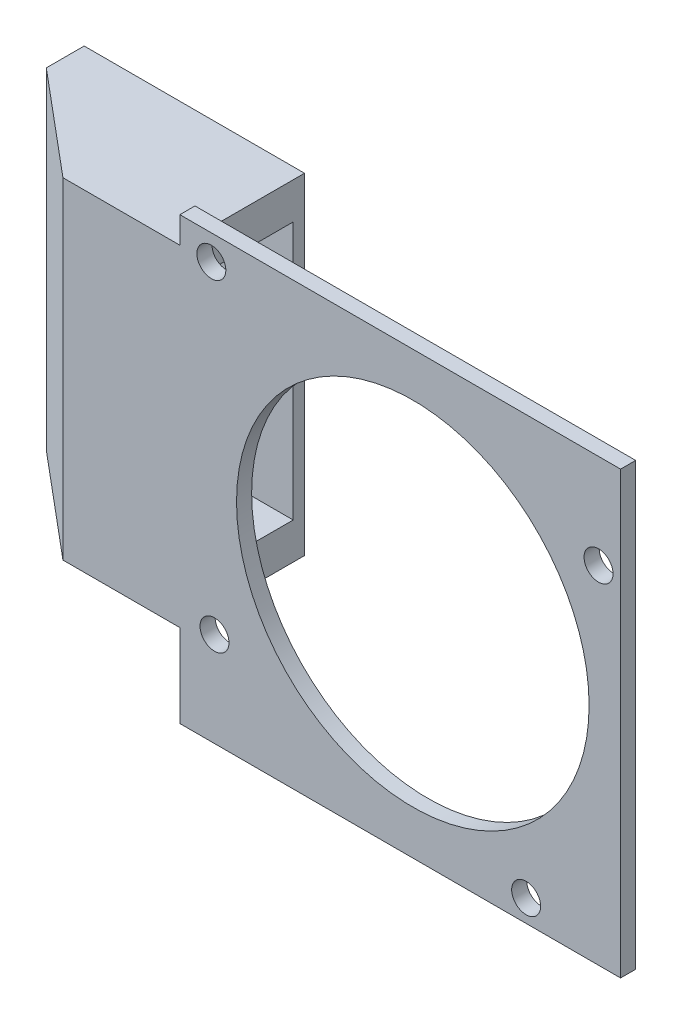
ISO-10303-21;
HEADER;
FILE_DESCRIPTION(('STEP AP214'),'2;1');
FILE_NAME('part.step','',(''),(''),'','','');
FILE_SCHEMA(('AUTOMOTIVE_DESIGN { 1 0 10303 214 1 1 1 1 }'));
ENDSEC;
DATA;
#1=APPLICATION_CONTEXT('core data for automotive mechanical design processes');
#2=APPLICATION_PROTOCOL_DEFINITION('international standard','automotive_design',2000,#1);
#3=PRODUCT_CONTEXT('',#1,'mechanical');
#4=PRODUCT('Part','Part','',(#3));
#5=PRODUCT_RELATED_PRODUCT_CATEGORY('part','',(#4));
#6=PRODUCT_DEFINITION_FORMATION('','',#4);
#7=PRODUCT_DEFINITION_CONTEXT('part definition',#1,'design');
#8=PRODUCT_DEFINITION('design','',#6,#7);
#9=PRODUCT_DEFINITION_SHAPE('','',#8);
#10=(LENGTH_UNIT() NAMED_UNIT(*) SI_UNIT(.MILLI.,.METRE.));
#11=(NAMED_UNIT(*) PLANE_ANGLE_UNIT() SI_UNIT($,.RADIAN.));
#12=(NAMED_UNIT(*) SI_UNIT($,.STERADIAN.) SOLID_ANGLE_UNIT());
#13=UNCERTAINTY_MEASURE_WITH_UNIT(LENGTH_MEASURE(1.E-05),#10,'distance_accuracy_value','');
#14=(GEOMETRIC_REPRESENTATION_CONTEXT(3) GLOBAL_UNCERTAINTY_ASSIGNED_CONTEXT((#13)) GLOBAL_UNIT_ASSIGNED_CONTEXT((#10,
#11,#12)) REPRESENTATION_CONTEXT('',''));
#15=CARTESIAN_POINT('',(0.,0.,0.));
#16=DIRECTION('',(0.,0.,1.));
#17=DIRECTION('',(1.,0.,0.));
#18=AXIS2_PLACEMENT_3D('',#15,#16,#17);
#19=CARTESIAN_POINT('',(29.8,35.,0.));
#20=DIRECTION('',(0.,1.,0.));
#21=DIRECTION('',(1.,0.,0.));
#22=AXIS2_PLACEMENT_3D('',#19,#20,#21);
#23=PLANE('',#22);
#24=DIRECTION('',(1.,0.,0.));
#25=VECTOR('',#24,1.);
#26=CARTESIAN_POINT('',(29.8,35.,0.));
#27=LINE('',#26,#25);
#28=CARTESIAN_POINT('',(0.,35.,0.));
#29=VERTEX_POINT('',#28);
#30=CARTESIAN_POINT('',(35.,35.,0.));
#31=VERTEX_POINT('',#30);
#32=EDGE_CURVE('E278',#29,#31,#27,.T.);
#33=ORIENTED_EDGE('',*,*,#32,.F.);
#34=DIRECTION('',(0.,0.,1.));
#35=VECTOR('',#34,1.);
#36=CARTESIAN_POINT('',(0.,35.,0.6));
#37=LINE('',#36,#35);
#38=CARTESIAN_POINT('',(0.,35.,1.2));
#39=VERTEX_POINT('',#38);
#40=EDGE_CURVE('E270',#29,#39,#37,.T.);
#41=ORIENTED_EDGE('',*,*,#40,.T.);
#42=DIRECTION('',(-1.,0.,0.));
#43=VECTOR('',#42,1.);
#44=CARTESIAN_POINT('',(29.8,35.,1.2));
#45=LINE('',#44,#43);
#46=CARTESIAN_POINT('',(35.,35.,1.2));
#47=VERTEX_POINT('',#46);
#48=EDGE_CURVE('E279',#47,#39,#45,.T.);
#49=ORIENTED_EDGE('',*,*,#48,.F.);
#50=DIRECTION('',(0.,0.,1.));
#51=VECTOR('',#50,1.);
#52=CARTESIAN_POINT('',(35.,35.,0.6));
#53=LINE('',#52,#51);
#54=EDGE_CURVE('E26',#31,#47,#53,.T.);
#55=ORIENTED_EDGE('',*,*,#54,.F.);
#56=EDGE_LOOP('',(#33,#41,#49,#55));
#57=FACE_BOUND('',#56,.T.);
#58=ADVANCED_FACE('F15',(#57),#23,.T.);
#59=CARTESIAN_POINT('',(5.2,0.,0.));
#60=DIRECTION('',(0.,-1.,0.));
#61=DIRECTION('',(0.,0.,-1.));
#62=AXIS2_PLACEMENT_3D('',#59,#60,#61);
#63=PLANE('',#62);
#64=DIRECTION('',(-1.,0.,0.));
#65=VECTOR('',#64,1.);
#66=CARTESIAN_POINT('',(5.2,0.,0.));
#67=LINE('',#66,#65);
#68=CARTESIAN_POINT('',(35.,0.,0.));
#69=VERTEX_POINT('',#68);
#70=CARTESIAN_POINT('',(0.,0.,0.));
#71=VERTEX_POINT('',#70);
#72=EDGE_CURVE('E326',#69,#71,#67,.T.);
#73=ORIENTED_EDGE('',*,*,#72,.F.);
#74=DIRECTION('',(0.,0.,1.));
#75=VECTOR('',#74,1.);
#76=CARTESIAN_POINT('',(35.,0.,0.6));
#77=LINE('',#76,#75);
#78=CARTESIAN_POINT('',(35.,0.,1.2));
#79=VERTEX_POINT('',#78);
#80=EDGE_CURVE('E10',#69,#79,#77,.T.);
#81=ORIENTED_EDGE('',*,*,#80,.T.);
#82=DIRECTION('',(1.,0.,0.));
#83=VECTOR('',#82,1.);
#84=CARTESIAN_POINT('',(5.2,0.,1.2));
#85=LINE('',#84,#83);
#86=CARTESIAN_POINT('',(0.,0.,1.2));
#87=VERTEX_POINT('',#86);
#88=EDGE_CURVE('E315',#87,#79,#85,.T.);
#89=ORIENTED_EDGE('',*,*,#88,.F.);
#90=DIRECTION('',(0.,0.,1.));
#91=VECTOR('',#90,1.);
#92=CARTESIAN_POINT('',(0.,0.,0.6));
#93=LINE('',#92,#91);
#94=EDGE_CURVE('E399',#71,#87,#93,.T.);
#95=ORIENTED_EDGE('',*,*,#94,.F.);
#96=EDGE_LOOP('',(#73,#81,#89,#95));
#97=FACE_BOUND('',#96,.T.);
#98=ADVANCED_FACE('F560',(#97),#63,.T.);
#99=CARTESIAN_POINT('',(35.,5.2,0.));
#100=DIRECTION('',(1.,0.,0.));
#101=DIRECTION('',(0.,1.,0.));
#102=AXIS2_PLACEMENT_3D('',#99,#100,#101);
#103=PLANE('',#102);
#104=DIRECTION('',(0.,-1.,0.));
#105=VECTOR('',#104,1.);
#106=CARTESIAN_POINT('',(35.,0.,0.));
#107=LINE('',#106,#105);
#108=EDGE_CURVE('E374',#31,#69,#107,.T.);
#109=ORIENTED_EDGE('',*,*,#108,.F.);
#110=ORIENTED_EDGE('',*,*,#54,.T.);
#111=DIRECTION('',(0.,1.,0.));
#112=VECTOR('',#111,1.);
#113=CARTESIAN_POINT('',(35.,0.,1.2));
#114=LINE('',#113,#112);
#115=EDGE_CURVE('E283',#79,#47,#114,.T.);
#116=ORIENTED_EDGE('',*,*,#115,.F.);
#117=ORIENTED_EDGE('',*,*,#80,.F.);
#118=EDGE_LOOP('',(#109,#110,#116,#117));
#119=FACE_BOUND('',#118,.T.);
#120=ADVANCED_FACE('F564',(#119),#103,.T.);
#121=CARTESIAN_POINT('',(18.5,17.5,0.));
#122=DIRECTION('',(0.,0.,1.));
#123=DIRECTION('',(1.,0.,0.));
#124=AXIS2_PLACEMENT_3D('',#121,#122,#123);
#125=CYLINDRICAL_SURFACE('',#124,14.);
#126=CARTESIAN_POINT('',(18.5,17.5,1.2));
#127=DIRECTION('',(0.,0.,-1.));
#128=DIRECTION('',(1.,0.,0.));
#129=AXIS2_PLACEMENT_3D('',#126,#127,#128);
#130=CIRCLE('',#129,14.);
#131=CARTESIAN_POINT('',(4.5,17.5,1.2));
#132=VERTEX_POINT('',#131);
#133=EDGE_CURVE('E282',#132,#132,#130,.T.);
#134=ORIENTED_EDGE('',*,*,#133,.F.);
#135=DIRECTION('',(0.,0.,-1.));
#136=VECTOR('',#135,1.);
#137=CARTESIAN_POINT('',(4.5,17.5,0.));
#138=LINE('',#137,#136);
#139=CARTESIAN_POINT('',(4.5,17.5,0.));
#140=VERTEX_POINT('',#139);
#141=EDGE_CURVE('E40',#132,#140,#138,.T.);
#142=ORIENTED_EDGE('',*,*,#141,.T.);
#143=CARTESIAN_POINT('',(18.5,17.5,0.));
#144=DIRECTION('',(0.,0.,-1.));
#145=DIRECTION('',(1.,0.,0.));
#146=AXIS2_PLACEMENT_3D('',#143,#144,#145);
#147=CIRCLE('',#146,14.);
#148=EDGE_CURVE('E343',#140,#140,#147,.T.);
#149=ORIENTED_EDGE('',*,*,#148,.T.);
#150=ORIENTED_EDGE('',*,*,#141,.F.);
#151=EDGE_LOOP('',(#134,#142,#149,#150));
#152=FACE_BOUND('',#151,.T.);
#153=ADVANCED_FACE('F879',(#152),#125,.F.);
#154=CARTESIAN_POINT('',(2.5,33.,0.));
#155=DIRECTION('',(0.,0.,1.));
#156=DIRECTION('',(1.,0.,0.));
#157=AXIS2_PLACEMENT_3D('',#154,#155,#156);
#158=CYLINDRICAL_SURFACE('',#157,1.15);
#159=CARTESIAN_POINT('',(2.5,33.,1.2));
#160=DIRECTION('',(0.,0.,-1.));
#161=DIRECTION('',(1.,0.,0.));
#162=AXIS2_PLACEMENT_3D('',#159,#160,#161);
#163=CIRCLE('',#162,1.15);
#164=CARTESIAN_POINT('',(1.35,33.,1.2));
#165=VERTEX_POINT('',#164);
#166=EDGE_CURVE('E378',#165,#165,#163,.T.);
#167=ORIENTED_EDGE('',*,*,#166,.F.);
#168=DIRECTION('',(0.,0.,-1.));
#169=VECTOR('',#168,1.);
#170=CARTESIAN_POINT('',(1.35,33.,0.));
#171=LINE('',#170,#169);
#172=CARTESIAN_POINT('',(1.35,33.,0.));
#173=VERTEX_POINT('',#172);
#174=EDGE_CURVE('E393',#165,#173,#171,.T.);
#175=ORIENTED_EDGE('',*,*,#174,.T.);
#176=CARTESIAN_POINT('',(2.5,33.,0.));
#177=DIRECTION('',(0.,0.,-1.));
#178=DIRECTION('',(1.,0.,0.));
#179=AXIS2_PLACEMENT_3D('',#176,#177,#178);
#180=CIRCLE('',#179,1.15);
#181=EDGE_CURVE('E310',#173,#173,#180,.T.);
#182=ORIENTED_EDGE('',*,*,#181,.T.);
#183=ORIENTED_EDGE('',*,*,#174,.F.);
#184=EDGE_LOOP('',(#167,#175,#182,#183));
#185=FACE_BOUND('',#184,.T.);
#186=ADVANCED_FACE('F834',(#185),#158,.F.);
#187=CARTESIAN_POINT('',(27.5,1.75,0.));
#188=DIRECTION('',(0.,0.,1.));
#189=DIRECTION('',(1.,0.,0.));
#190=AXIS2_PLACEMENT_3D('',#187,#188,#189);
#191=CYLINDRICAL_SURFACE('',#190,1.15);
#192=CARTESIAN_POINT('',(27.5,1.75,1.2));
#193=DIRECTION('',(0.,0.,-1.));
#194=DIRECTION('',(1.,0.,0.));
#195=AXIS2_PLACEMENT_3D('',#192,#193,#194);
#196=CIRCLE('',#195,1.15);
#197=CARTESIAN_POINT('',(26.35,1.75,1.2));
#198=VERTEX_POINT('',#197);
#199=EDGE_CURVE('E359',#198,#198,#196,.T.);
#200=ORIENTED_EDGE('',*,*,#199,.F.);
#201=DIRECTION('',(0.,0.,-1.));
#202=VECTOR('',#201,1.);
#203=CARTESIAN_POINT('',(26.35,1.75,0.));
#204=LINE('',#203,#202);
#205=CARTESIAN_POINT('',(26.35,1.75,0.));
#206=VERTEX_POINT('',#205);
#207=EDGE_CURVE('E446',#198,#206,#204,.T.);
#208=ORIENTED_EDGE('',*,*,#207,.T.);
#209=CARTESIAN_POINT('',(27.5,1.75,0.));
#210=DIRECTION('',(0.,0.,-1.));
#211=DIRECTION('',(1.,0.,0.));
#212=AXIS2_PLACEMENT_3D('',#209,#210,#211);
#213=CIRCLE('',#212,1.15);
#214=EDGE_CURVE('E306',#206,#206,#213,.T.);
#215=ORIENTED_EDGE('',*,*,#214,.T.);
#216=ORIENTED_EDGE('',*,*,#207,.F.);
#217=EDGE_LOOP('',(#200,#208,#215,#216));
#218=FACE_BOUND('',#217,.T.);
#219=ADVANCED_FACE('F829',(#218),#191,.F.);
#220=CARTESIAN_POINT('',(33.25,27.5,0.));
#221=DIRECTION('',(0.,0.,1.));
#222=DIRECTION('',(1.,0.,0.));
#223=AXIS2_PLACEMENT_3D('',#220,#221,#222);
#224=CYLINDRICAL_SURFACE('',#223,1.15);
#225=CARTESIAN_POINT('',(33.25,27.5,1.2));
#226=DIRECTION('',(0.,0.,-1.));
#227=DIRECTION('',(1.,0.,0.));
#228=AXIS2_PLACEMENT_3D('',#225,#226,#227);
#229=CIRCLE('',#228,1.15);
#230=CARTESIAN_POINT('',(32.1,27.5,1.2));
#231=VERTEX_POINT('',#230);
#232=EDGE_CURVE('E354',#231,#231,#229,.T.);
#233=ORIENTED_EDGE('',*,*,#232,.F.);
#234=DIRECTION('',(0.,0.,-1.));
#235=VECTOR('',#234,1.);
#236=CARTESIAN_POINT('',(32.1,27.5,0.));
#237=LINE('',#236,#235);
#238=CARTESIAN_POINT('',(32.1,27.5,0.));
#239=VERTEX_POINT('',#238);
#240=EDGE_CURVE('E353',#231,#239,#237,.T.);
#241=ORIENTED_EDGE('',*,*,#240,.T.);
#242=CARTESIAN_POINT('',(33.25,27.5,0.));
#243=DIRECTION('',(0.,0.,-1.));
#244=DIRECTION('',(1.,0.,0.));
#245=AXIS2_PLACEMENT_3D('',#242,#243,#244);
#246=CIRCLE('',#245,1.15);
#247=EDGE_CURVE('E311',#239,#239,#246,.T.);
#248=ORIENTED_EDGE('',*,*,#247,.T.);
#249=ORIENTED_EDGE('',*,*,#240,.F.);
#250=EDGE_LOOP('',(#233,#241,#248,#249));
#251=FACE_BOUND('',#250,.T.);
#252=ADVANCED_FACE('F833',(#251),#224,.F.);
#253=CARTESIAN_POINT('',(2.75,7.5,0.));
#254=DIRECTION('',(0.,0.,1.));
#255=DIRECTION('',(1.,0.,0.));
#256=AXIS2_PLACEMENT_3D('',#253,#254,#255);
#257=CYLINDRICAL_SURFACE('',#256,1.15);
#258=CARTESIAN_POINT('',(2.75,7.5,1.2));
#259=DIRECTION('',(0.,0.,-1.));
#260=DIRECTION('',(1.,0.,0.));
#261=AXIS2_PLACEMENT_3D('',#258,#259,#260);
#262=CIRCLE('',#261,1.15);
#263=CARTESIAN_POINT('',(1.6,7.5,1.2));
#264=VERTEX_POINT('',#263);
#265=EDGE_CURVE('E358',#264,#264,#262,.T.);
#266=ORIENTED_EDGE('',*,*,#265,.F.);
#267=DIRECTION('',(0.,0.,-1.));
#268=VECTOR('',#267,1.);
#269=CARTESIAN_POINT('',(1.6,7.5,0.));
#270=LINE('',#269,#268);
#271=CARTESIAN_POINT('',(1.6,7.5,0.));
#272=VERTEX_POINT('',#271);
#273=EDGE_CURVE('E346',#264,#272,#270,.T.);
#274=ORIENTED_EDGE('',*,*,#273,.T.);
#275=CARTESIAN_POINT('',(2.75,7.5,0.));
#276=DIRECTION('',(0.,0.,-1.));
#277=DIRECTION('',(1.,0.,0.));
#278=AXIS2_PLACEMENT_3D('',#275,#276,#277);
#279=CIRCLE('',#278,1.15);
#280=EDGE_CURVE('E322',#272,#272,#279,.T.);
#281=ORIENTED_EDGE('',*,*,#280,.T.);
#282=ORIENTED_EDGE('',*,*,#273,.F.);
#283=EDGE_LOOP('',(#266,#274,#281,#282));
#284=FACE_BOUND('',#283,.T.);
#285=ADVANCED_FACE('F810',(#284),#257,.F.);
#286=CARTESIAN_POINT('',(17.5,17.5,0.));
#287=DIRECTION('',(0.,0.,1.));
#288=DIRECTION('',(1.,0.,0.));
#289=AXIS2_PLACEMENT_3D('',#286,#287,#288);
#290=PLANE('',#289);
#291=ORIENTED_EDGE('',*,*,#148,.F.);
#292=EDGE_LOOP('',(#291));
#293=FACE_BOUND('',#292,.T.);
#294=ORIENTED_EDGE('',*,*,#181,.F.);
#295=EDGE_LOOP('',(#294));
#296=FACE_BOUND('',#295,.T.);
#297=ORIENTED_EDGE('',*,*,#214,.F.);
#298=EDGE_LOOP('',(#297));
#299=FACE_BOUND('',#298,.T.);
#300=ORIENTED_EDGE('',*,*,#247,.F.);
#301=EDGE_LOOP('',(#300));
#302=FACE_BOUND('',#301,.T.);
#303=ORIENTED_EDGE('',*,*,#280,.F.);
#304=EDGE_LOOP('',(#303));
#305=FACE_BOUND('',#304,.T.);
#306=DIRECTION('',(0.,-1.,0.));
#307=VECTOR('',#306,1.);
#308=CARTESIAN_POINT('',(-8.32573692237548,23.75,0.));
#309=LINE('',#308,#307);
#310=CARTESIAN_POINT('',(-8.32573692237548,30.,0.));
#311=VERTEX_POINT('',#310);
#312=CARTESIAN_POINT('',(-8.32573692237548,9.5,0.));
#313=VERTEX_POINT('',#312);
#314=EDGE_CURVE('E305',#311,#313,#309,.T.);
#315=ORIENTED_EDGE('',*,*,#314,.F.);
#316=DIRECTION('',(1.,0.,0.));
#317=VECTOR('',#316,1.);
#318=CARTESIAN_POINT('',(0.,30.,0.));
#319=LINE('',#318,#317);
#320=CARTESIAN_POINT('',(0.,30.,0.));
#321=VERTEX_POINT('',#320);
#322=EDGE_CURVE('E295',#311,#321,#319,.T.);
#323=ORIENTED_EDGE('',*,*,#322,.T.);
#324=DIRECTION('',(0.,1.,0.));
#325=VECTOR('',#324,1.);
#326=CARTESIAN_POINT('',(0.,35.,0.));
#327=LINE('',#326,#325);
#328=CARTESIAN_POINT('',(0.,32.9,0.));
#329=VERTEX_POINT('',#328);
#330=EDGE_CURVE('E466',#321,#329,#327,.T.);
#331=ORIENTED_EDGE('',*,*,#330,.T.);
#332=DIRECTION('',(0.,1.,0.));
#333=VECTOR('',#332,1.);
#334=CARTESIAN_POINT('',(0.,35.,0.));
#335=LINE('',#334,#333);
#336=EDGE_CURVE('E265',#329,#29,#335,.T.);
#337=ORIENTED_EDGE('',*,*,#336,.T.);
#338=ORIENTED_EDGE('',*,*,#32,.T.);
#339=ORIENTED_EDGE('',*,*,#108,.T.);
#340=ORIENTED_EDGE('',*,*,#72,.T.);
#341=DIRECTION('',(0.,1.,0.));
#342=VECTOR('',#341,1.);
#343=CARTESIAN_POINT('',(0.,35.,0.));
#344=LINE('',#343,#342);
#345=CARTESIAN_POINT('',(-1.0547118733939E-13,6.6,0.));
#346=VERTEX_POINT('',#345);
#347=EDGE_CURVE('E19',#71,#346,#344,.T.);
#348=ORIENTED_EDGE('',*,*,#347,.T.);
#349=DIRECTION('',(0.,1.,0.));
#350=VECTOR('',#349,1.);
#351=CARTESIAN_POINT('',(0.,35.,0.));
#352=LINE('',#351,#350);
#353=CARTESIAN_POINT('',(0.,9.5,0.));
#354=VERTEX_POINT('',#353);
#355=EDGE_CURVE('E237',#346,#354,#352,.T.);
#356=ORIENTED_EDGE('',*,*,#355,.T.);
#357=DIRECTION('',(-1.,0.,0.));
#358=VECTOR('',#357,1.);
#359=CARTESIAN_POINT('',(-10.,9.5,0.));
#360=LINE('',#359,#358);
#361=EDGE_CURVE('E274',#354,#313,#360,.T.);
#362=ORIENTED_EDGE('',*,*,#361,.T.);
#363=EDGE_LOOP('',(#315,#323,#331,#337,#338,#339,#340,#348,#356,#362));
#364=FACE_BOUND('',#363,.T.);
#365=ADVANCED_FACE('F477',(#293,#296,#299,#302,#305,#364),#290,.F.);
#366=CARTESIAN_POINT('',(-10.,30.,0.6));
#367=DIRECTION('',(-0.642787609686539,0.,0.766044443118978));
#368=DIRECTION('',(0.,1.,0.));
#369=AXIS2_PLACEMENT_3D('',#366,#367,#368);
#370=PLANE('',#369);
#371=DIRECTION('',(0.,1.,0.));
#372=VECTOR('',#371,1.);
#373=CARTESIAN_POINT('',(-17.5,30.,-5.6932472338296));
#374=LINE('',#373,#372);
#375=CARTESIAN_POINT('',(-17.5,6.6,-5.6932472338296));
#376=VERTEX_POINT('',#375);
#377=CARTESIAN_POINT('',(-17.5,32.9,-5.6932472338296));
#378=VERTEX_POINT('',#377);
#379=EDGE_CURVE('E236',#376,#378,#374,.T.);
#380=ORIENTED_EDGE('',*,*,#379,.F.);
#381=DIRECTION('',(-0.766044443118979,0.,-0.642787609686538));
#382=VECTOR('',#381,1.);
#383=CARTESIAN_POINT('',(-10.6672830851419,6.6,0.0400830093665941));
#384=LINE('',#383,#382);
#385=CARTESIAN_POINT('',(-9.28494784444347,6.6,1.2));
#386=VERTEX_POINT('',#385);
#387=EDGE_CURVE('E434',#386,#376,#384,.T.);
#388=ORIENTED_EDGE('',*,*,#387,.F.);
#389=DIRECTION('',(0.,-1.,0.));
#390=VECTOR('',#389,1.);
#391=CARTESIAN_POINT('',(-9.28494784444347,8.6,1.2));
#392=LINE('',#391,#390);
#393=CARTESIAN_POINT('',(-9.28494784444347,32.9,1.2));
#394=VERTEX_POINT('',#393);
#395=EDGE_CURVE('E269',#394,#386,#392,.T.);
#396=ORIENTED_EDGE('',*,*,#395,.F.);
#397=DIRECTION('',(0.766044443118978,0.,0.642787609686539));
#398=VECTOR('',#397,1.);
#399=CARTESIAN_POINT('',(-17.5,32.9,-5.6932472338296));
#400=LINE('',#399,#398);
#401=EDGE_CURVE('E398',#378,#394,#400,.T.);
#402=ORIENTED_EDGE('',*,*,#401,.F.);
#403=EDGE_LOOP('',(#380,#388,#396,#402));
#404=FACE_BOUND('',#403,.T.);
#405=ADVANCED_FACE('F545',(#404),#370,.T.);
#406=CARTESIAN_POINT('',(-17.5,30.,-5.6932472338296));
#407=DIRECTION('',(-1.,0.,0.));
#408=DIRECTION('',(0.,0.,1.));
#409=AXIS2_PLACEMENT_3D('',#406,#407,#408);
#410=PLANE('',#409);
#411=ORIENTED_EDGE('',*,*,#379,.T.);
#412=DIRECTION('',(0.,0.,1.));
#413=VECTOR('',#412,1.);
#414=CARTESIAN_POINT('',(-17.5,32.9,-7.8));
#415=LINE('',#414,#413);
#416=CARTESIAN_POINT('',(-17.5,32.9,-8.7));
#417=VERTEX_POINT('',#416);
#418=EDGE_CURVE('E316',#417,#378,#415,.T.);
#419=ORIENTED_EDGE('',*,*,#418,.F.);
#420=DIRECTION('',(0.,1.,0.));
#421=VECTOR('',#420,1.);
#422=CARTESIAN_POINT('',(-17.5,8.6,-8.7));
#423=LINE('',#422,#421);
#424=CARTESIAN_POINT('',(-17.5,30.,-8.7));
#425=VERTEX_POINT('',#424);
#426=EDGE_CURVE('E243',#425,#417,#423,.T.);
#427=ORIENTED_EDGE('',*,*,#426,.F.);
#428=DIRECTION('',(0.,0.,-1.));
#429=VECTOR('',#428,1.);
#430=CARTESIAN_POINT('',(-17.5,30.,-7.8));
#431=LINE('',#430,#429);
#432=CARTESIAN_POINT('',(-17.5,30.,-7.8));
#433=VERTEX_POINT('',#432);
#434=EDGE_CURVE('E240',#433,#425,#431,.T.);
#435=ORIENTED_EDGE('',*,*,#434,.F.);
#436=DIRECTION('',(0.,1.,0.));
#437=VECTOR('',#436,1.);
#438=CARTESIAN_POINT('',(-17.5,30.,-7.8));
#439=LINE('',#438,#437);
#440=CARTESIAN_POINT('',(-17.5,9.5,-7.8));
#441=VERTEX_POINT('',#440);
#442=EDGE_CURVE('E224',#441,#433,#439,.T.);
#443=ORIENTED_EDGE('',*,*,#442,.F.);
#444=DIRECTION('',(0.,0.,-1.));
#445=VECTOR('',#444,1.);
#446=CARTESIAN_POINT('',(-17.5,9.5,-7.8));
#447=LINE('',#446,#445);
#448=CARTESIAN_POINT('',(-17.5,9.5,-8.7));
#449=VERTEX_POINT('',#448);
#450=EDGE_CURVE('E530',#441,#449,#447,.T.);
#451=ORIENTED_EDGE('',*,*,#450,.T.);
#452=DIRECTION('',(0.,-1.,0.));
#453=VECTOR('',#452,1.);
#454=CARTESIAN_POINT('',(-17.5,8.6,-8.7));
#455=LINE('',#454,#453);
#456=CARTESIAN_POINT('',(-17.5,6.6,-8.7));
#457=VERTEX_POINT('',#456);
#458=EDGE_CURVE('E414',#449,#457,#455,.T.);
#459=ORIENTED_EDGE('',*,*,#458,.T.);
#460=DIRECTION('',(0.,0.,-1.));
#461=VECTOR('',#460,1.);
#462=CARTESIAN_POINT('',(-17.5,6.6,-5.6932472338296));
#463=LINE('',#462,#461);
#464=EDGE_CURVE('E289',#376,#457,#463,.T.);
#465=ORIENTED_EDGE('',*,*,#464,.F.);
#466=EDGE_LOOP('',(#411,#419,#427,#435,#443,#451,#459,#465));
#467=FACE_BOUND('',#466,.T.);
#468=ADVANCED_FACE('F241',(#467),#410,.T.);
#469=CARTESIAN_POINT('',(-17.5,30.,-7.8));
#470=DIRECTION('',(0.,0.,-1.));
#471=DIRECTION('',(-1.,0.,0.));
#472=AXIS2_PLACEMENT_3D('',#469,#470,#471);
#473=PLANE('',#472);
#474=DIRECTION('',(1.,0.,0.));
#475=VECTOR('',#474,1.);
#476=CARTESIAN_POINT('',(-16.375,30.,-7.8));
#477=LINE('',#476,#475);
#478=CARTESIAN_POINT('',(-16.9,30.,-7.8));
#479=VERTEX_POINT('',#478);
#480=EDGE_CURVE('E229',#433,#479,#477,.T.);
#481=ORIENTED_EDGE('',*,*,#480,.T.);
#482=DIRECTION('',(0.,-1.,0.));
#483=VECTOR('',#482,1.);
#484=CARTESIAN_POINT('',(-16.9,30.,-7.8));
#485=LINE('',#484,#483);
#486=CARTESIAN_POINT('',(-16.9,9.5,-7.8));
#487=VERTEX_POINT('',#486);
#488=EDGE_CURVE('E271',#479,#487,#485,.T.);
#489=ORIENTED_EDGE('',*,*,#488,.T.);
#490=DIRECTION('',(-1.,0.,0.));
#491=VECTOR('',#490,1.);
#492=CARTESIAN_POINT('',(-17.5,9.5,-7.8));
#493=LINE('',#492,#491);
#494=EDGE_CURVE('E231',#487,#441,#493,.T.);
#495=ORIENTED_EDGE('',*,*,#494,.T.);
#496=ORIENTED_EDGE('',*,*,#442,.T.);
#497=EDGE_LOOP('',(#481,#489,#495,#496));
#498=FACE_BOUND('',#497,.T.);
#499=ADVANCED_FACE('F226',(#498),#473,.T.);
#500=CARTESIAN_POINT('',(0.,30.,0.6));
#501=DIRECTION('',(1.,0.,0.));
#502=DIRECTION('',(0.,0.,-1.));
#503=AXIS2_PLACEMENT_3D('',#500,#501,#502);
#504=PLANE('',#503);
#505=ORIENTED_EDGE('',*,*,#330,.F.);
#506=DIRECTION('',(0.,0.,-1.));
#507=VECTOR('',#506,1.);
#508=CARTESIAN_POINT('',(0.,30.,0.6));
#509=LINE('',#508,#507);
#510=CARTESIAN_POINT('',(0.,30.,-7.8));
#511=VERTEX_POINT('',#510);
#512=EDGE_CURVE('E293',#321,#511,#509,.T.);
#513=ORIENTED_EDGE('',*,*,#512,.T.);
#514=DIRECTION('',(0.,-1.,0.));
#515=VECTOR('',#514,1.);
#516=CARTESIAN_POINT('',(0.,30.9,-7.79999999999977));
#517=LINE('',#516,#515);
#518=CARTESIAN_POINT('',(0.,9.5,-7.8));
#519=VERTEX_POINT('',#518);
#520=EDGE_CURVE('E404',#511,#519,#517,.T.);
#521=ORIENTED_EDGE('',*,*,#520,.T.);
#522=DIRECTION('',(0.,0.,1.));
#523=VECTOR('',#522,1.);
#524=CARTESIAN_POINT('',(0.,9.5,-7.8));
#525=LINE('',#524,#523);
#526=EDGE_CURVE('E362',#519,#354,#525,.T.);
#527=ORIENTED_EDGE('',*,*,#526,.T.);
#528=ORIENTED_EDGE('',*,*,#355,.F.);
#529=DIRECTION('',(0.,0.,1.));
#530=VECTOR('',#529,1.);
#531=CARTESIAN_POINT('',(0.,6.6,-7.79999999999977));
#532=LINE('',#531,#530);
#533=CARTESIAN_POINT('',(0.,6.6,-8.69999999999977));
#534=VERTEX_POINT('',#533);
#535=EDGE_CURVE('E288',#534,#346,#532,.T.);
#536=ORIENTED_EDGE('',*,*,#535,.F.);
#537=DIRECTION('',(0.,1.,0.));
#538=VECTOR('',#537,1.);
#539=CARTESIAN_POINT('',(0.,30.9,-8.69999999999977));
#540=LINE('',#539,#538);
#541=CARTESIAN_POINT('',(0.,32.9,-8.69999999999977));
#542=VERTEX_POINT('',#541);
#543=EDGE_CURVE('E400',#534,#542,#540,.T.);
#544=ORIENTED_EDGE('',*,*,#543,.T.);
#545=DIRECTION('',(0.,0.,-1.));
#546=VECTOR('',#545,1.);
#547=CARTESIAN_POINT('',(0.,32.9,-1.8));
#548=LINE('',#547,#546);
#549=EDGE_CURVE('E412',#329,#542,#548,.T.);
#550=ORIENTED_EDGE('',*,*,#549,.F.);
#551=EDGE_LOOP('',(#505,#513,#521,#527,#528,#536,#544,#550));
#552=FACE_BOUND('',#551,.T.);
#553=ADVANCED_FACE('F489',(#552),#504,.T.);
#554=CARTESIAN_POINT('',(-8.75,19.75,-7.79999999999988));
#555=DIRECTION('',(0.,0.,-1.));
#556=DIRECTION('',(0.,-1.,0.));
#557=AXIS2_PLACEMENT_3D('',#554,#555,#556);
#558=PLANE('',#557);
#559=DIRECTION('',(0.,1.,0.));
#560=VECTOR('',#559,1.);
#561=CARTESIAN_POINT('',(-14.2550125628932,30.,-7.8));
#562=LINE('',#561,#560);
#563=CARTESIAN_POINT('',(-14.2550125628932,9.5,-7.8));
#564=VERTEX_POINT('',#563);
#565=CARTESIAN_POINT('',(-14.2550125628932,30.,-7.8));
#566=VERTEX_POINT('',#565);
#567=EDGE_CURVE('E379',#564,#566,#562,.T.);
#568=ORIENTED_EDGE('',*,*,#567,.F.);
#569=DIRECTION('',(1.,0.,0.));
#570=VECTOR('',#569,1.);
#571=CARTESIAN_POINT('',(-17.5,9.5,-7.8));
#572=LINE('',#571,#570);
#573=EDGE_CURVE('E366',#564,#519,#572,.T.);
#574=ORIENTED_EDGE('',*,*,#573,.T.);
#575=ORIENTED_EDGE('',*,*,#520,.F.);
#576=DIRECTION('',(-1.,0.,0.));
#577=VECTOR('',#576,1.);
#578=CARTESIAN_POINT('',(0.,30.,-7.8));
#579=LINE('',#578,#577);
#580=EDGE_CURVE('E290',#511,#566,#579,.T.);
#581=ORIENTED_EDGE('',*,*,#580,.T.);
#582=EDGE_LOOP('',(#568,#574,#575,#581));
#583=FACE_BOUND('',#582,.T.);
#584=ADVANCED_FACE('F523',(#583),#558,.F.);
#585=CARTESIAN_POINT('',(-8.75,19.75,-8.69999999999988));
#586=DIRECTION('',(0.,0.,-1.));
#587=DIRECTION('',(0.,-1.,0.));
#588=AXIS2_PLACEMENT_3D('',#585,#586,#587);
#589=PLANE('',#588);
#590=ORIENTED_EDGE('',*,*,#458,.F.);
#591=DIRECTION('',(1.,0.,0.));
#592=VECTOR('',#591,1.);
#593=CARTESIAN_POINT('',(-15.25,9.5,-8.7));
#594=LINE('',#593,#592);
#595=CARTESIAN_POINT('',(-15.25,9.5,-8.7));
#596=VERTEX_POINT('',#595);
#597=EDGE_CURVE('E386',#449,#596,#594,.T.);
#598=ORIENTED_EDGE('',*,*,#597,.T.);
#599=DIRECTION('',(0.,1.,0.));
#600=VECTOR('',#599,1.);
#601=CARTESIAN_POINT('',(-15.25,30.,-8.7));
#602=LINE('',#601,#600);
#603=CARTESIAN_POINT('',(-15.25,30.,-8.7));
#604=VERTEX_POINT('',#603);
#605=EDGE_CURVE('E335',#596,#604,#602,.T.);
#606=ORIENTED_EDGE('',*,*,#605,.T.);
#607=DIRECTION('',(-1.,0.,0.));
#608=VECTOR('',#607,1.);
#609=CARTESIAN_POINT('',(-20.25,30.,-8.7));
#610=LINE('',#609,#608);
#611=EDGE_CURVE('E247',#604,#425,#610,.T.);
#612=ORIENTED_EDGE('',*,*,#611,.T.);
#613=ORIENTED_EDGE('',*,*,#426,.T.);
#614=DIRECTION('',(-1.,0.,0.));
#615=VECTOR('',#614,1.);
#616=CARTESIAN_POINT('',(-17.5,32.9,-8.7));
#617=LINE('',#616,#615);
#618=EDGE_CURVE('E321',#542,#417,#617,.T.);
#619=ORIENTED_EDGE('',*,*,#618,.F.);
#620=ORIENTED_EDGE('',*,*,#543,.F.);
#621=DIRECTION('',(1.,0.,0.));
#622=VECTOR('',#621,1.);
#623=CARTESIAN_POINT('',(0.,6.6,-8.69999999999977));
#624=LINE('',#623,#622);
#625=EDGE_CURVE('E284',#457,#534,#624,.T.);
#626=ORIENTED_EDGE('',*,*,#625,.F.);
#627=EDGE_LOOP('',(#590,#598,#606,#612,#613,#619,#620,#626));
#628=FACE_BOUND('',#627,.T.);
#629=ADVANCED_FACE('F527',(#628),#589,.T.);
#630=CARTESIAN_POINT('',(17.5,17.5,1.2));
#631=DIRECTION('',(0.,0.,1.));
#632=DIRECTION('',(1.,0.,0.));
#633=AXIS2_PLACEMENT_3D('',#630,#631,#632);
#634=PLANE('',#633);
#635=ORIENTED_EDGE('',*,*,#265,.T.);
#636=EDGE_LOOP('',(#635));
#637=FACE_BOUND('',#636,.T.);
#638=ORIENTED_EDGE('',*,*,#232,.T.);
#639=EDGE_LOOP('',(#638));
#640=FACE_BOUND('',#639,.T.);
#641=ORIENTED_EDGE('',*,*,#199,.T.);
#642=EDGE_LOOP('',(#641));
#643=FACE_BOUND('',#642,.T.);
#644=ORIENTED_EDGE('',*,*,#166,.T.);
#645=EDGE_LOOP('',(#644));
#646=FACE_BOUND('',#645,.T.);
#647=ORIENTED_EDGE('',*,*,#133,.T.);
#648=EDGE_LOOP('',(#647));
#649=FACE_BOUND('',#648,.T.);
#650=ORIENTED_EDGE('',*,*,#395,.T.);
#651=DIRECTION('',(-1.,0.,0.));
#652=VECTOR('',#651,1.);
#653=CARTESIAN_POINT('',(0.,6.6,1.2));
#654=LINE('',#653,#652);
#655=CARTESIAN_POINT('',(0.,6.6,1.2));
#656=VERTEX_POINT('',#655);
#657=EDGE_CURVE('E331',#656,#386,#654,.T.);
#658=ORIENTED_EDGE('',*,*,#657,.F.);
#659=DIRECTION('',(0.,-1.,0.));
#660=VECTOR('',#659,1.);
#661=CARTESIAN_POINT('',(0.,35.,1.2));
#662=LINE('',#661,#660);
#663=EDGE_CURVE('E394',#656,#87,#662,.T.);
#664=ORIENTED_EDGE('',*,*,#663,.T.);
#665=ORIENTED_EDGE('',*,*,#88,.T.);
#666=ORIENTED_EDGE('',*,*,#115,.T.);
#667=ORIENTED_EDGE('',*,*,#48,.T.);
#668=DIRECTION('',(0.,-1.,0.));
#669=VECTOR('',#668,1.);
#670=CARTESIAN_POINT('',(0.,35.,1.2));
#671=LINE('',#670,#669);
#672=CARTESIAN_POINT('',(0.,32.9,1.2));
#673=VERTEX_POINT('',#672);
#674=EDGE_CURVE('E320',#39,#673,#671,.T.);
#675=ORIENTED_EDGE('',*,*,#674,.T.);
#676=DIRECTION('',(1.,0.,0.));
#677=VECTOR('',#676,1.);
#678=CARTESIAN_POINT('',(-10.,32.9,1.2));
#679=LINE('',#678,#677);
#680=EDGE_CURVE('E413',#394,#673,#679,.T.);
#681=ORIENTED_EDGE('',*,*,#680,.F.);
#682=EDGE_LOOP('',(#650,#658,#664,#665,#666,#667,#675,#681));
#683=FACE_BOUND('',#682,.T.);
#684=ADVANCED_FACE('F17',(#637,#640,#643,#646,#649,#683),#634,.T.);
#685=CARTESIAN_POINT('',(0.,33.25,0.));
#686=DIRECTION('',(-1.,0.,0.));
#687=DIRECTION('',(0.,1.,0.));
#688=AXIS2_PLACEMENT_3D('',#685,#686,#687);
#689=PLANE('',#688);
#690=DIRECTION('',(0.,0.,1.));
#691=VECTOR('',#690,1.);
#692=CARTESIAN_POINT('',(0.,32.9,-1.8));
#693=LINE('',#692,#691);
#694=EDGE_CURVE('E408',#329,#673,#693,.T.);
#695=ORIENTED_EDGE('',*,*,#694,.T.);
#696=ORIENTED_EDGE('',*,*,#674,.F.);
#697=ORIENTED_EDGE('',*,*,#40,.F.);
#698=ORIENTED_EDGE('',*,*,#336,.F.);
#699=EDGE_LOOP('',(#695,#696,#697,#698));
#700=FACE_BOUND('',#699,.T.);
#701=ADVANCED_FACE('F483',(#700),#689,.T.);
#702=CARTESIAN_POINT('',(-8.75,32.9,-3.6));
#703=DIRECTION('',(0.,1.,0.));
#704=DIRECTION('',(1.,0.,0.));
#705=AXIS2_PLACEMENT_3D('',#702,#703,#704);
#706=PLANE('',#705);
#707=ORIENTED_EDGE('',*,*,#401,.T.);
#708=ORIENTED_EDGE('',*,*,#680,.T.);
#709=ORIENTED_EDGE('',*,*,#694,.F.);
#710=ORIENTED_EDGE('',*,*,#549,.T.);
#711=ORIENTED_EDGE('',*,*,#618,.T.);
#712=ORIENTED_EDGE('',*,*,#418,.T.);
#713=EDGE_LOOP('',(#707,#708,#709,#710,#711,#712));
#714=FACE_BOUND('',#713,.T.);
#715=ADVANCED_FACE('F495',(#714),#706,.T.);
#716=CARTESIAN_POINT('',(0.,33.25,0.));
#717=DIRECTION('',(-1.,0.,0.));
#718=DIRECTION('',(0.,1.,0.));
#719=AXIS2_PLACEMENT_3D('',#716,#717,#718);
#720=PLANE('',#719);
#721=DIRECTION('',(0.,0.,-1.));
#722=VECTOR('',#721,1.);
#723=CARTESIAN_POINT('',(0.,6.6,-1.8));
#724=LINE('',#723,#722);
#725=EDGE_CURVE('E327',#656,#346,#724,.T.);
#726=ORIENTED_EDGE('',*,*,#725,.T.);
#727=ORIENTED_EDGE('',*,*,#347,.F.);
#728=ORIENTED_EDGE('',*,*,#94,.T.);
#729=ORIENTED_EDGE('',*,*,#663,.F.);
#730=EDGE_LOOP('',(#726,#727,#728,#729));
#731=FACE_BOUND('',#730,.T.);
#732=ADVANCED_FACE('F554',(#731),#720,.T.);
#733=CARTESIAN_POINT('',(-8.75,6.6,-3.6));
#734=DIRECTION('',(0.,-1.,0.));
#735=DIRECTION('',(0.,0.,-1.));
#736=AXIS2_PLACEMENT_3D('',#733,#734,#735);
#737=PLANE('',#736);
#738=ORIENTED_EDGE('',*,*,#387,.T.);
#739=ORIENTED_EDGE('',*,*,#464,.T.);
#740=ORIENTED_EDGE('',*,*,#625,.T.);
#741=ORIENTED_EDGE('',*,*,#535,.T.);
#742=ORIENTED_EDGE('',*,*,#725,.F.);
#743=ORIENTED_EDGE('',*,*,#657,.T.);
#744=EDGE_LOOP('',(#738,#739,#740,#741,#742,#743));
#745=FACE_BOUND('',#744,.T.);
#746=ADVANCED_FACE('F550',(#745),#737,.T.);
#747=CARTESIAN_POINT('',(-8.75,9.5,-3.6));
#748=DIRECTION('',(0.,-1.,0.));
#749=DIRECTION('',(0.,0.,-1.));
#750=AXIS2_PLACEMENT_3D('',#747,#748,#749);
#751=PLANE('',#750);
#752=CARTESIAN_POINT('',(-8.32573692237548,9.5,-4.));
#753=DIRECTION('',(0.,1.,0.));
#754=DIRECTION('',(-0.34202014332567,0.,0.939692620785908));
#755=AXIS2_PLACEMENT_3D('',#752,#753,#754);
#756=CIRCLE('',#755,4.);
#757=CARTESIAN_POINT('',(-10.8968873611216,9.5,-0.935822227524092));
#758=VERTEX_POINT('',#757);
#759=EDGE_CURVE('E300',#758,#313,#756,.T.);
#760=ORIENTED_EDGE('',*,*,#759,.T.);
#761=ORIENTED_EDGE('',*,*,#361,.F.);
#762=ORIENTED_EDGE('',*,*,#526,.F.);
#763=ORIENTED_EDGE('',*,*,#573,.F.);
#764=CARTESIAN_POINT('',(-14.2550125628932,9.5,-8.8));
#765=DIRECTION('',(0.,1.,0.));
#766=DIRECTION('',(-0.994987437106621,0.,0.0999999999999869));
#767=AXIS2_PLACEMENT_3D('',#764,#765,#766);
#768=CIRCLE('',#767,1.);
#769=EDGE_CURVE('E383',#596,#564,#768,.T.);
#770=ORIENTED_EDGE('',*,*,#769,.F.);
#771=ORIENTED_EDGE('',*,*,#597,.F.);
#772=ORIENTED_EDGE('',*,*,#450,.F.);
#773=ORIENTED_EDGE('',*,*,#494,.F.);
#774=CARTESIAN_POINT('',(-12.9001844900539,9.5,-7.83841726687876));
#775=DIRECTION('',(0.,1.,0.));
#776=DIRECTION('',(-0.999953877486531,0.,0.00960431671968909));
#777=AXIS2_PLACEMENT_3D('',#774,#775,#776);
#778=CIRCLE('',#777,4.);
#779=CARTESIAN_POINT('',(-15.4713349288,9.5,-4.77423949440285));
#780=VERTEX_POINT('',#779);
#781=EDGE_CURVE('E275',#487,#780,#778,.T.);
#782=ORIENTED_EDGE('',*,*,#781,.T.);
#783=DIRECTION('',(-0.766044443118977,0.,-0.64278760968654));
#784=VECTOR('',#783,1.);
#785=CARTESIAN_POINT('',(-15.3594690491567,9.5,-4.68037287605284));
#786=LINE('',#785,#784);
#787=EDGE_CURVE('E299',#758,#780,#786,.T.);
#788=ORIENTED_EDGE('',*,*,#787,.F.);
#789=EDGE_LOOP('',(#760,#761,#762,#763,#770,#771,#772,#773,#782,#788));
#790=FACE_BOUND('',#789,.T.);
#791=ADVANCED_FACE('F519',(#790),#751,.F.);
#792=CARTESIAN_POINT('',(-12.9001844900539,30.,-7.83841726687876));
#793=DIRECTION('',(0.,1.,0.));
#794=DIRECTION('',(-0.999953877486531,0.,0.00960431671968909));
#795=AXIS2_PLACEMENT_3D('',#792,#793,#794);
#796=CYLINDRICAL_SURFACE('',#795,4.);
#797=CARTESIAN_POINT('',(-12.9001844900539,30.,-7.83841726687876));
#798=DIRECTION('',(0.,-1.,0.));
#799=DIRECTION('',(-0.999953877486531,0.,0.00960431671968909));
#800=AXIS2_PLACEMENT_3D('',#797,#798,#799);
#801=CIRCLE('',#800,4.);
#802=CARTESIAN_POINT('',(-15.4713349288,30.,-4.77423949440285));
#803=VERTEX_POINT('',#802);
#804=EDGE_CURVE('E253',#803,#479,#801,.T.);
#805=ORIENTED_EDGE('',*,*,#804,.F.);
#806=DIRECTION('',(0.,-1.,0.));
#807=VECTOR('',#806,1.);
#808=CARTESIAN_POINT('',(-15.4713349288,30.,-4.77423949440285));
#809=LINE('',#808,#807);
#810=EDGE_CURVE('E336',#803,#780,#809,.T.);
#811=ORIENTED_EDGE('',*,*,#810,.T.);
#812=ORIENTED_EDGE('',*,*,#781,.F.);
#813=ORIENTED_EDGE('',*,*,#488,.F.);
#814=EDGE_LOOP('',(#805,#811,#812,#813));
#815=FACE_BOUND('',#814,.T.);
#816=ADVANCED_FACE('F851',(#815),#796,.F.);
#817=CARTESIAN_POINT('',(-16.9,30.,-5.9730318287226));
#818=DIRECTION('',(0.642787609686541,0.,-0.766044443118977));
#819=DIRECTION('',(0.,-1.,0.));
#820=AXIS2_PLACEMENT_3D('',#817,#818,#819);
#821=PLANE('',#820);
#822=DIRECTION('',(0.,1.,0.));
#823=VECTOR('',#822,1.);
#824=CARTESIAN_POINT('',(-10.8968873611216,23.75,-0.93582222752409));
#825=LINE('',#824,#823);
#826=CARTESIAN_POINT('',(-10.8968873611216,30.,-0.935822227524091));
#827=VERTEX_POINT('',#826);
#828=EDGE_CURVE('E304',#758,#827,#825,.T.);
#829=ORIENTED_EDGE('',*,*,#828,.F.);
#830=ORIENTED_EDGE('',*,*,#787,.T.);
#831=ORIENTED_EDGE('',*,*,#810,.F.);
#832=DIRECTION('',(0.766044443118977,0.,0.64278760968654));
#833=VECTOR('',#832,1.);
#834=CARTESIAN_POINT('',(-16.9,30.,-5.9730318287226));
#835=LINE('',#834,#833);
#836=EDGE_CURVE('E260',#803,#827,#835,.T.);
#837=ORIENTED_EDGE('',*,*,#836,.T.);
#838=EDGE_LOOP('',(#829,#830,#831,#837));
#839=FACE_BOUND('',#838,.T.);
#840=ADVANCED_FACE('F856',(#839),#821,.T.);
#841=CARTESIAN_POINT('',(-8.75,30.,-3.6));
#842=DIRECTION('',(0.,1.,0.));
#843=DIRECTION('',(1.,0.,0.));
#844=AXIS2_PLACEMENT_3D('',#841,#842,#843);
#845=PLANE('',#844);
#846=CARTESIAN_POINT('',(-8.32573692237548,30.,-4.));
#847=DIRECTION('',(0.,-1.,0.));
#848=DIRECTION('',(-0.34202014332567,0.,0.939692620785908));
#849=AXIS2_PLACEMENT_3D('',#846,#847,#848);
#850=CIRCLE('',#849,4.);
#851=EDGE_CURVE('E332',#311,#827,#850,.T.);
#852=ORIENTED_EDGE('',*,*,#851,.T.);
#853=ORIENTED_EDGE('',*,*,#836,.F.);
#854=ORIENTED_EDGE('',*,*,#804,.T.);
#855=ORIENTED_EDGE('',*,*,#480,.F.);
#856=ORIENTED_EDGE('',*,*,#434,.T.);
#857=ORIENTED_EDGE('',*,*,#611,.F.);
#858=CARTESIAN_POINT('',(-14.2550125628932,30.,-8.8));
#859=DIRECTION('',(0.,1.,0.));
#860=DIRECTION('',(-0.994987437106621,0.,0.0999999999999869));
#861=AXIS2_PLACEMENT_3D('',#858,#859,#860);
#862=CIRCLE('',#861,1.);
#863=EDGE_CURVE('E350',#604,#566,#862,.T.);
#864=ORIENTED_EDGE('',*,*,#863,.T.);
#865=ORIENTED_EDGE('',*,*,#580,.F.);
#866=ORIENTED_EDGE('',*,*,#512,.F.);
#867=ORIENTED_EDGE('',*,*,#322,.F.);
#868=EDGE_LOOP('',(#852,#853,#854,#855,#856,#857,#864,#865,#866,#867));
#869=FACE_BOUND('',#868,.T.);
#870=ADVANCED_FACE('F250',(#869),#845,.F.);
#871=CARTESIAN_POINT('',(-8.32573692237548,23.75,-4.));
#872=DIRECTION('',(0.,1.,0.));
#873=DIRECTION('',(-0.34202014332567,0.,0.939692620785908));
#874=AXIS2_PLACEMENT_3D('',#871,#872,#873);
#875=CYLINDRICAL_SURFACE('',#874,4.);
#876=ORIENTED_EDGE('',*,*,#851,.F.);
#877=ORIENTED_EDGE('',*,*,#314,.T.);
#878=ORIENTED_EDGE('',*,*,#759,.F.);
#879=ORIENTED_EDGE('',*,*,#828,.T.);
#880=EDGE_LOOP('',(#876,#877,#878,#879));
#881=FACE_BOUND('',#880,.T.);
#882=ADVANCED_FACE('F887',(#881),#875,.F.);
#883=CARTESIAN_POINT('',(-14.2550125628932,30.,-8.8));
#884=DIRECTION('',(0.,1.,0.));
#885=DIRECTION('',(-0.994987437106621,0.,0.0999999999999869));
#886=AXIS2_PLACEMENT_3D('',#883,#884,#885);
#887=CYLINDRICAL_SURFACE('',#886,1.);
#888=ORIENTED_EDGE('',*,*,#769,.T.);
#889=ORIENTED_EDGE('',*,*,#567,.T.);
#890=ORIENTED_EDGE('',*,*,#863,.F.);
#891=ORIENTED_EDGE('',*,*,#605,.F.);
#892=EDGE_LOOP('',(#888,#889,#890,#891));
#893=FACE_BOUND('',#892,.T.);
#894=ADVANCED_FACE('F514',(#893),#887,.T.);
#895=CLOSED_SHELL('',(#58,#98,#120,#153,#186,#219,#252,#285,#365,#405,#468,#499,#553,#584,#629,
#684,#701,#715,#732,#746,#791,#816,#840,#870,#882,#894));
#896=MANIFOLD_SOLID_BREP('B1',#895);
#897=ADVANCED_BREP_SHAPE_REPRESENTATION('',(#18,#896),#14);
#898=SHAPE_DEFINITION_REPRESENTATION(#9,#897);
ENDSEC;
END-ISO-10303-21;
